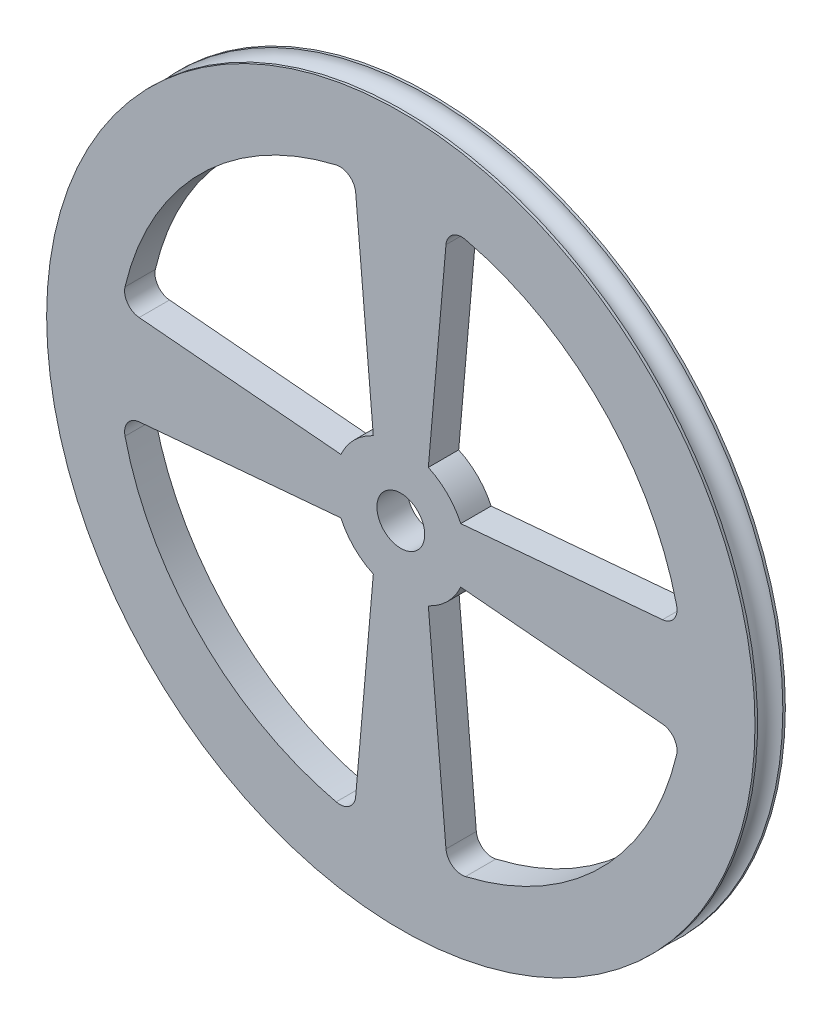
ISO-10303-21;
HEADER;
FILE_DESCRIPTION(('STEP AP214'),'2;1');
FILE_NAME('part.step','',(''),(''),'','','');
FILE_SCHEMA(('AUTOMOTIVE_DESIGN { 1 0 10303 214 1 1 1 1 }'));
ENDSEC;
DATA;
#1=APPLICATION_CONTEXT('core data for automotive mechanical design processes');
#2=APPLICATION_PROTOCOL_DEFINITION('international standard','automotive_design',2000,#1);
#3=PRODUCT_CONTEXT('',#1,'mechanical');
#4=PRODUCT('Part','Part','',(#3));
#5=PRODUCT_RELATED_PRODUCT_CATEGORY('part','',(#4));
#6=PRODUCT_DEFINITION_FORMATION('','',#4);
#7=PRODUCT_DEFINITION_CONTEXT('part definition',#1,'design');
#8=PRODUCT_DEFINITION('design','',#6,#7);
#9=PRODUCT_DEFINITION_SHAPE('','',#8);
#10=(LENGTH_UNIT() NAMED_UNIT(*) SI_UNIT(.MILLI.,.METRE.));
#11=(NAMED_UNIT(*) PLANE_ANGLE_UNIT() SI_UNIT($,.RADIAN.));
#12=(NAMED_UNIT(*) SI_UNIT($,.STERADIAN.) SOLID_ANGLE_UNIT());
#13=UNCERTAINTY_MEASURE_WITH_UNIT(LENGTH_MEASURE(1.E-05),#10,'distance_accuracy_value','');
#14=(GEOMETRIC_REPRESENTATION_CONTEXT(3) GLOBAL_UNCERTAINTY_ASSIGNED_CONTEXT((#13)) GLOBAL_UNIT_ASSIGNED_CONTEXT((#10,
#11,#12)) REPRESENTATION_CONTEXT('',''));
#15=CARTESIAN_POINT('',(0.,0.,0.));
#16=DIRECTION('',(0.,0.,1.));
#17=DIRECTION('',(1.,0.,0.));
#18=AXIS2_PLACEMENT_3D('',#15,#16,#17);
#19=CARTESIAN_POINT('',(0.,0.,3.81));
#20=DIRECTION('',(0.,0.,-1.));
#21=DIRECTION('',(-1.,0.,0.));
#22=AXIS2_PLACEMENT_3D('',#19,#20,#21);
#23=CYLINDRICAL_SURFACE('',#22,44.45);
#24=CARTESIAN_POINT('',(0.,0.,0.317500000000001));
#25=DIRECTION('',(0.,0.,1.));
#26=DIRECTION('',(1.,0.,0.));
#27=AXIS2_PLACEMENT_3D('',#24,#25,#26);
#28=CIRCLE('',#27,44.45);
#29=CARTESIAN_POINT('',(44.45,0.,0.317500000000001));
#30=VERTEX_POINT('',#29);
#31=EDGE_CURVE('E36',#30,#30,#28,.F.);
#32=ORIENTED_EDGE('',*,*,#31,.T.);
#33=EDGE_LOOP('',(#32));
#34=FACE_BOUND('',#33,.T.);
#35=CARTESIAN_POINT('',(0.,0.,0.));
#36=DIRECTION('',(0.,0.,1.));
#37=DIRECTION('',(1.,0.,0.));
#38=AXIS2_PLACEMENT_3D('',#35,#36,#37);
#39=CIRCLE('',#38,44.45);
#40=CARTESIAN_POINT('',(44.45,0.,0.));
#41=VERTEX_POINT('',#40);
#42=EDGE_CURVE('E316',#41,#41,#39,.T.);
#43=ORIENTED_EDGE('',*,*,#42,.T.);
#44=EDGE_LOOP('',(#43));
#45=FACE_BOUND('',#44,.T.);
#46=ADVANCED_FACE('F32',(#34,#45),#23,.T.);
#47=CARTESIAN_POINT('',(0.,0.,3.81));
#48=DIRECTION('',(0.,0.,1.));
#49=DIRECTION('',(1.,0.,0.));
#50=AXIS2_PLACEMENT_3D('',#47,#48,#49);
#51=PLANE('',#50);
#52=DIRECTION('',(0.996194698091746,-0.087155742747654,0.));
#53=VECTOR('',#52,1.);
#54=CARTESIAN_POINT('',(-7.52235999953092,3.4521212229198,3.81));
#55=LINE('',#54,#53);
#56=CARTESIAN_POINT('',(-32.8385381614744,5.66699981589231,3.81));
#57=VERTEX_POINT('',#56);
#58=CARTESIAN_POINT('',(-7.52235999953092,3.4521212229198,3.81));
#59=VERTEX_POINT('',#58);
#60=EDGE_CURVE('E293',#57,#59,#55,.T.);
#61=ORIENTED_EDGE('',*,*,#60,.F.);
#62=CARTESIAN_POINT('',(-32.6642266759791,7.6593892120758,3.81));
#63=DIRECTION('',(0.,0.,1.));
#64=DIRECTION('',(1.,0.,0.));
#65=AXIS2_PLACEMENT_3D('',#62,#63,#64);
#66=CIRCLE('',#65,2.);
#67=CARTESIAN_POINT('',(-34.6114101359556,8.11598156110711,3.81));
#68=VERTEX_POINT('',#67);
#69=EDGE_CURVE('E379',#57,#68,#66,.F.);
#70=ORIENTED_EDGE('',*,*,#69,.T.);
#71=CARTESIAN_POINT('',(0.,0.,3.81));
#72=DIRECTION('',(0.,0.,1.));
#73=DIRECTION('',(1.,0.,0.));
#74=AXIS2_PLACEMENT_3D('',#71,#72,#73);
#75=CIRCLE('',#74,35.5502302144383);
#76=CARTESIAN_POINT('',(-8.11598156110738,34.6114101359555,3.81));
#77=VERTEX_POINT('',#76);
#78=EDGE_CURVE('E290',#77,#68,#75,.T.);
#79=ORIENTED_EDGE('',*,*,#78,.F.);
#80=CARTESIAN_POINT('',(-7.65938921207605,32.664226675979,3.81));
#81=DIRECTION('',(0.,0.,1.));
#82=DIRECTION('',(1.,0.,0.));
#83=AXIS2_PLACEMENT_3D('',#80,#81,#82);
#84=CIRCLE('',#83,2.);
#85=CARTESIAN_POINT('',(-5.66699981589256,32.8385381614743,3.81));
#86=VERTEX_POINT('',#85);
#87=EDGE_CURVE('E375',#77,#86,#84,.F.);
#88=ORIENTED_EDGE('',*,*,#87,.T.);
#89=DIRECTION('',(-0.0871557427476618,0.996194698091745,0.));
#90=VECTOR('',#89,1.);
#91=CARTESIAN_POINT('',(-3.45212122291986,7.5223599995309,3.81));
#92=LINE('',#91,#90);
#93=CARTESIAN_POINT('',(-3.45212122291986,7.5223599995309,3.81));
#94=VERTEX_POINT('',#93);
#95=EDGE_CURVE('E299',#94,#86,#92,.T.);
#96=ORIENTED_EDGE('',*,*,#95,.F.);
#97=CARTESIAN_POINT('',(0.,0.,3.81));
#98=DIRECTION('',(0.,0.,-1.));
#99=DIRECTION('',(1.,0.,0.));
#100=AXIS2_PLACEMENT_3D('',#97,#98,#99);
#101=CIRCLE('',#100,8.2766563840887);
#102=EDGE_CURVE('E296',#59,#94,#101,.T.);
#103=ORIENTED_EDGE('',*,*,#102,.F.);
#104=EDGE_LOOP('',(#61,#70,#79,#88,#96,#103));
#105=FACE_BOUND('',#104,.T.);
#106=CARTESIAN_POINT('',(0.,0.,3.81));
#107=DIRECTION('',(0.,0.,1.));
#108=DIRECTION('',(1.,0.,0.));
#109=AXIS2_PLACEMENT_3D('',#106,#107,#108);
#110=CIRCLE('',#109,44.45);
#111=CARTESIAN_POINT('',(44.45,0.,3.81));
#112=VERTEX_POINT('',#111);
#113=EDGE_CURVE('E317',#112,#112,#110,.T.);
#114=ORIENTED_EDGE('',*,*,#113,.T.);
#115=EDGE_LOOP('',(#114));
#116=FACE_BOUND('',#115,.T.);
#117=CARTESIAN_POINT('',(0.,0.,3.81));
#118=DIRECTION('',(0.,0.,1.));
#119=DIRECTION('',(1.,0.,0.));
#120=AXIS2_PLACEMENT_3D('',#117,#118,#119);
#121=CIRCLE('',#120,3.);
#122=CARTESIAN_POINT('',(3.,0.,3.81));
#123=VERTEX_POINT('',#122);
#124=EDGE_CURVE('E284',#123,#123,#121,.T.);
#125=ORIENTED_EDGE('',*,*,#124,.F.);
#126=EDGE_LOOP('',(#125));
#127=FACE_BOUND('',#126,.T.);
#128=DIRECTION('',(0.087155742747662,-0.996194698091745,0.));
#129=VECTOR('',#128,1.);
#130=CARTESIAN_POINT('',(3.45212122291986,-7.5223599995309,3.81));
#131=LINE('',#130,#129);
#132=CARTESIAN_POINT('',(3.45212122291986,-7.5223599995309,3.81));
#133=VERTEX_POINT('',#132);
#134=CARTESIAN_POINT('',(5.66699981589257,-32.8385381614743,3.81));
#135=VERTEX_POINT('',#134);
#136=EDGE_CURVE('E262',#133,#135,#131,.T.);
#137=ORIENTED_EDGE('',*,*,#136,.F.);
#138=CARTESIAN_POINT('',(0.,0.,3.81));
#139=DIRECTION('',(0.,0.,-1.));
#140=DIRECTION('',(1.,0.,0.));
#141=AXIS2_PLACEMENT_3D('',#138,#139,#140);
#142=CIRCLE('',#141,8.2766563840887);
#143=CARTESIAN_POINT('',(7.52235999953092,-3.4521212229198,3.81));
#144=VERTEX_POINT('',#143);
#145=EDGE_CURVE('E260',#144,#133,#142,.T.);
#146=ORIENTED_EDGE('',*,*,#145,.F.);
#147=DIRECTION('',(-0.996194698091746,0.0871557427476539,0.));
#148=VECTOR('',#147,1.);
#149=CARTESIAN_POINT('',(7.52235999953092,-3.4521212229198,3.81));
#150=LINE('',#149,#148);
#151=CARTESIAN_POINT('',(32.8385381614744,-5.6669998158923,3.81));
#152=VERTEX_POINT('',#151);
#153=EDGE_CURVE('E268',#152,#144,#150,.T.);
#154=ORIENTED_EDGE('',*,*,#153,.F.);
#155=CARTESIAN_POINT('',(32.6642266759791,-7.6593892120758,3.81));
#156=DIRECTION('',(0.,0.,1.));
#157=DIRECTION('',(1.,0.,0.));
#158=AXIS2_PLACEMENT_3D('',#155,#156,#157);
#159=CIRCLE('',#158,2.);
#160=CARTESIAN_POINT('',(34.6114101359556,-8.11598156110711,3.81));
#161=VERTEX_POINT('',#160);
#162=EDGE_CURVE('E334',#152,#161,#159,.F.);
#163=ORIENTED_EDGE('',*,*,#162,.T.);
#164=CARTESIAN_POINT('',(0.,0.,3.81));
#165=DIRECTION('',(0.,0.,1.));
#166=DIRECTION('',(1.,0.,0.));
#167=AXIS2_PLACEMENT_3D('',#164,#165,#166);
#168=CIRCLE('',#167,35.5502302144383);
#169=CARTESIAN_POINT('',(8.11598156110739,-34.6114101359555,3.81));
#170=VERTEX_POINT('',#169);
#171=EDGE_CURVE('E266',#170,#161,#168,.T.);
#172=ORIENTED_EDGE('',*,*,#171,.F.);
#173=CARTESIAN_POINT('',(7.65938921207606,-32.664226675979,3.81));
#174=DIRECTION('',(0.,0.,1.));
#175=DIRECTION('',(1.,0.,0.));
#176=AXIS2_PLACEMENT_3D('',#173,#174,#175);
#177=CIRCLE('',#176,2.);
#178=EDGE_CURVE('E11',#170,#135,#177,.F.);
#179=ORIENTED_EDGE('',*,*,#178,.T.);
#180=EDGE_LOOP('',(#137,#146,#154,#163,#172,#179));
#181=FACE_BOUND('',#180,.T.);
#182=DIRECTION('',(0.0871557427476541,0.996194698091746,0.));
#183=VECTOR('',#182,1.);
#184=CARTESIAN_POINT('',(-3.4521212229198,-7.52235999953092,3.81));
#185=LINE('',#184,#183);
#186=CARTESIAN_POINT('',(-5.66699981589231,-32.8385381614744,3.81));
#187=VERTEX_POINT('',#186);
#188=CARTESIAN_POINT('',(-3.4521212229198,-7.52235999953092,3.81));
#189=VERTEX_POINT('',#188);
#190=EDGE_CURVE('E236',#187,#189,#185,.T.);
#191=ORIENTED_EDGE('',*,*,#190,.F.);
#192=CARTESIAN_POINT('',(-7.6593892120758,-32.6642266759791,3.81));
#193=DIRECTION('',(0.,0.,1.));
#194=DIRECTION('',(1.,0.,0.));
#195=AXIS2_PLACEMENT_3D('',#192,#193,#194);
#196=CIRCLE('',#195,2.);
#197=CARTESIAN_POINT('',(-8.11598156110711,-34.6114101359556,3.81));
#198=VERTEX_POINT('',#197);
#199=EDGE_CURVE('E387',#187,#198,#196,.F.);
#200=ORIENTED_EDGE('',*,*,#199,.T.);
#201=CARTESIAN_POINT('',(0.,0.,3.81));
#202=DIRECTION('',(0.,0.,1.));
#203=DIRECTION('',(1.,0.,0.));
#204=AXIS2_PLACEMENT_3D('',#201,#202,#203);
#205=CIRCLE('',#204,35.5502302144383);
#206=CARTESIAN_POINT('',(-34.6114101359555,-8.11598156110739,3.81));
#207=VERTEX_POINT('',#206);
#208=EDGE_CURVE('E233',#207,#198,#205,.T.);
#209=ORIENTED_EDGE('',*,*,#208,.F.);
#210=CARTESIAN_POINT('',(-32.664226675979,-7.65938921207606,3.81));
#211=DIRECTION('',(0.,0.,1.));
#212=DIRECTION('',(1.,0.,0.));
#213=AXIS2_PLACEMENT_3D('',#210,#211,#212);
#214=CIRCLE('',#213,2.);
#215=CARTESIAN_POINT('',(-32.8385381614743,-5.66699981589257,3.81));
#216=VERTEX_POINT('',#215);
#217=EDGE_CURVE('E383',#207,#216,#214,.F.);
#218=ORIENTED_EDGE('',*,*,#217,.T.);
#219=DIRECTION('',(-0.996194698091745,-0.087155742747662,0.));
#220=VECTOR('',#219,1.);
#221=CARTESIAN_POINT('',(-7.5223599995309,-3.45212122291986,3.81));
#222=LINE('',#221,#220);
#223=CARTESIAN_POINT('',(-7.5223599995309,-3.45212122291986,3.81));
#224=VERTEX_POINT('',#223);
#225=EDGE_CURVE('E242',#224,#216,#222,.T.);
#226=ORIENTED_EDGE('',*,*,#225,.F.);
#227=CARTESIAN_POINT('',(0.,0.,3.81));
#228=DIRECTION('',(0.,0.,-1.));
#229=DIRECTION('',(1.,0.,0.));
#230=AXIS2_PLACEMENT_3D('',#227,#228,#229);
#231=CIRCLE('',#230,8.2766563840887);
#232=EDGE_CURVE('E239',#189,#224,#231,.T.);
#233=ORIENTED_EDGE('',*,*,#232,.F.);
#234=EDGE_LOOP('',(#191,#200,#209,#218,#226,#233));
#235=FACE_BOUND('',#234,.T.);
#236=DIRECTION('',(-0.0871557427476542,-0.996194698091746,0.));
#237=VECTOR('',#236,1.);
#238=CARTESIAN_POINT('',(3.4521212229198,7.52235999953092,3.81));
#239=LINE('',#238,#237);
#240=CARTESIAN_POINT('',(5.66699981589231,32.8385381614744,3.81));
#241=VERTEX_POINT('',#240);
#242=CARTESIAN_POINT('',(3.4521212229198,7.52235999953092,3.81));
#243=VERTEX_POINT('',#242);
#244=EDGE_CURVE('E193',#241,#243,#239,.T.);
#245=ORIENTED_EDGE('',*,*,#244,.F.);
#246=CARTESIAN_POINT('',(7.6593892120758,32.6642266759791,3.81));
#247=DIRECTION('',(0.,0.,1.));
#248=DIRECTION('',(1.,0.,0.));
#249=AXIS2_PLACEMENT_3D('',#246,#247,#248);
#250=CIRCLE('',#249,2.);
#251=CARTESIAN_POINT('',(8.11598156110712,34.6114101359556,3.81));
#252=VERTEX_POINT('',#251);
#253=EDGE_CURVE('E371',#241,#252,#250,.F.);
#254=ORIENTED_EDGE('',*,*,#253,.T.);
#255=CARTESIAN_POINT('',(0.,0.,3.81));
#256=DIRECTION('',(0.,0.,1.));
#257=DIRECTION('',(1.,0.,0.));
#258=AXIS2_PLACEMENT_3D('',#255,#256,#257);
#259=CIRCLE('',#258,35.5502302144382);
#260=CARTESIAN_POINT('',(34.6114101359555,8.11598156110739,3.81));
#261=VERTEX_POINT('',#260);
#262=EDGE_CURVE('E205',#261,#252,#259,.T.);
#263=ORIENTED_EDGE('',*,*,#262,.F.);
#264=CARTESIAN_POINT('',(32.664226675979,7.65938921207606,3.81));
#265=DIRECTION('',(0.,0.,1.));
#266=DIRECTION('',(1.,0.,0.));
#267=AXIS2_PLACEMENT_3D('',#264,#265,#266);
#268=CIRCLE('',#267,2.);
#269=CARTESIAN_POINT('',(32.8385381614743,5.66699981589257,3.81));
#270=VERTEX_POINT('',#269);
#271=EDGE_CURVE('E339',#261,#270,#268,.F.);
#272=ORIENTED_EDGE('',*,*,#271,.T.);
#273=DIRECTION('',(0.996194698091745,0.0871557427476621,0.));
#274=VECTOR('',#273,1.);
#275=CARTESIAN_POINT('',(7.5223599995309,3.45212122291986,3.81));
#276=LINE('',#275,#274);
#277=CARTESIAN_POINT('',(7.5223599995309,3.45212122291986,3.81));
#278=VERTEX_POINT('',#277);
#279=EDGE_CURVE('E218',#278,#270,#276,.T.);
#280=ORIENTED_EDGE('',*,*,#279,.F.);
#281=CARTESIAN_POINT('',(0.,0.,3.81));
#282=DIRECTION('',(0.,0.,-1.));
#283=DIRECTION('',(1.,0.,0.));
#284=AXIS2_PLACEMENT_3D('',#281,#282,#283);
#285=CIRCLE('',#284,8.2766563840887);
#286=EDGE_CURVE('E204',#243,#278,#285,.T.);
#287=ORIENTED_EDGE('',*,*,#286,.F.);
#288=EDGE_LOOP('',(#245,#254,#263,#272,#280,#287));
#289=FACE_BOUND('',#288,.T.);
#290=ADVANCED_FACE('F216',(#105,#116,#127,#181,#235,#289),#51,.T.);
#291=CARTESIAN_POINT('',(0.,0.,0.));
#292=DIRECTION('',(0.,0.,1.));
#293=DIRECTION('',(1.,0.,0.));
#294=AXIS2_PLACEMENT_3D('',#291,#292,#293);
#295=PLANE('',#294);
#296=DIRECTION('',(-0.996194698091745,-0.087155742747662,0.));
#297=VECTOR('',#296,1.);
#298=CARTESIAN_POINT('',(-7.5223599995309,-3.45212122291986,0.));
#299=LINE('',#298,#297);
#300=CARTESIAN_POINT('',(-7.5223599995309,-3.45212122291986,0.));
#301=VERTEX_POINT('',#300);
#302=CARTESIAN_POINT('',(-32.8385381614743,-5.66699981589257,0.));
#303=VERTEX_POINT('',#302);
#304=EDGE_CURVE('E237',#301,#303,#299,.T.);
#305=ORIENTED_EDGE('',*,*,#304,.T.);
#306=CARTESIAN_POINT('',(-32.664226675979,-7.65938921207606,0.));
#307=DIRECTION('',(0.,0.,1.));
#308=DIRECTION('',(1.,0.,0.));
#309=AXIS2_PLACEMENT_3D('',#306,#307,#308);
#310=CIRCLE('',#309,2.);
#311=CARTESIAN_POINT('',(-34.6114101359555,-8.11598156110739,0.));
#312=VERTEX_POINT('',#311);
#313=EDGE_CURVE('E381',#303,#312,#310,.T.);
#314=ORIENTED_EDGE('',*,*,#313,.T.);
#315=CARTESIAN_POINT('',(0.,0.,0.));
#316=DIRECTION('',(0.,0.,1.));
#317=DIRECTION('',(1.,0.,0.));
#318=AXIS2_PLACEMENT_3D('',#315,#316,#317);
#319=CIRCLE('',#318,35.5502302144383);
#320=CARTESIAN_POINT('',(-8.11598156110711,-34.6114101359556,0.));
#321=VERTEX_POINT('',#320);
#322=EDGE_CURVE('E213',#312,#321,#319,.T.);
#323=ORIENTED_EDGE('',*,*,#322,.T.);
#324=CARTESIAN_POINT('',(-7.6593892120758,-32.6642266759791,0.));
#325=DIRECTION('',(0.,0.,1.));
#326=DIRECTION('',(1.,0.,0.));
#327=AXIS2_PLACEMENT_3D('',#324,#325,#326);
#328=CIRCLE('',#327,2.);
#329=CARTESIAN_POINT('',(-5.66699981589231,-32.8385381614744,0.));
#330=VERTEX_POINT('',#329);
#331=EDGE_CURVE('E385',#321,#330,#328,.T.);
#332=ORIENTED_EDGE('',*,*,#331,.T.);
#333=DIRECTION('',(0.0871557427476541,0.996194698091746,0.));
#334=VECTOR('',#333,1.);
#335=CARTESIAN_POINT('',(-3.4521212229198,-7.52235999953092,0.));
#336=LINE('',#335,#334);
#337=CARTESIAN_POINT('',(-3.4521212229198,-7.52235999953092,0.));
#338=VERTEX_POINT('',#337);
#339=EDGE_CURVE('E248',#330,#338,#336,.T.);
#340=ORIENTED_EDGE('',*,*,#339,.T.);
#341=CARTESIAN_POINT('',(0.,0.,0.));
#342=DIRECTION('',(0.,0.,-1.));
#343=DIRECTION('',(1.,0.,0.));
#344=AXIS2_PLACEMENT_3D('',#341,#342,#343);
#345=CIRCLE('',#344,8.2766563840887);
#346=EDGE_CURVE('E250',#338,#301,#345,.T.);
#347=ORIENTED_EDGE('',*,*,#346,.T.);
#348=EDGE_LOOP('',(#305,#314,#323,#332,#340,#347));
#349=FACE_BOUND('',#348,.T.);
#350=CARTESIAN_POINT('',(0.,0.,0.));
#351=DIRECTION('',(0.,0.,1.));
#352=DIRECTION('',(1.,0.,0.));
#353=AXIS2_PLACEMENT_3D('',#350,#351,#352);
#354=CIRCLE('',#353,3.);
#355=CARTESIAN_POINT('',(3.,0.,0.));
#356=VERTEX_POINT('',#355);
#357=EDGE_CURVE('E283',#356,#356,#354,.T.);
#358=ORIENTED_EDGE('',*,*,#357,.T.);
#359=EDGE_LOOP('',(#358));
#360=FACE_BOUND('',#359,.T.);
#361=DIRECTION('',(-0.0871557427476618,0.996194698091745,0.));
#362=VECTOR('',#361,1.);
#363=CARTESIAN_POINT('',(-3.45212122291986,7.5223599995309,0.));
#364=LINE('',#363,#362);
#365=CARTESIAN_POINT('',(-3.45212122291986,7.5223599995309,0.));
#366=VERTEX_POINT('',#365);
#367=CARTESIAN_POINT('',(-5.66699981589256,32.8385381614743,0.));
#368=VERTEX_POINT('',#367);
#369=EDGE_CURVE('E294',#366,#368,#364,.T.);
#370=ORIENTED_EDGE('',*,*,#369,.T.);
#371=CARTESIAN_POINT('',(-7.65938921207605,32.664226675979,0.));
#372=DIRECTION('',(0.,0.,1.));
#373=DIRECTION('',(1.,0.,0.));
#374=AXIS2_PLACEMENT_3D('',#371,#372,#373);
#375=CIRCLE('',#374,2.);
#376=CARTESIAN_POINT('',(-8.11598156110738,34.6114101359555,0.));
#377=VERTEX_POINT('',#376);
#378=EDGE_CURVE('E373',#368,#377,#375,.T.);
#379=ORIENTED_EDGE('',*,*,#378,.T.);
#380=CARTESIAN_POINT('',(0.,0.,0.));
#381=DIRECTION('',(0.,0.,1.));
#382=DIRECTION('',(1.,0.,0.));
#383=AXIS2_PLACEMENT_3D('',#380,#381,#382);
#384=CIRCLE('',#383,35.5502302144383);
#385=CARTESIAN_POINT('',(-34.6114101359556,8.11598156110711,0.));
#386=VERTEX_POINT('',#385);
#387=EDGE_CURVE('E287',#377,#386,#384,.T.);
#388=ORIENTED_EDGE('',*,*,#387,.T.);
#389=CARTESIAN_POINT('',(-32.6642266759791,7.6593892120758,0.));
#390=DIRECTION('',(0.,0.,1.));
#391=DIRECTION('',(1.,0.,0.));
#392=AXIS2_PLACEMENT_3D('',#389,#390,#391);
#393=CIRCLE('',#392,2.);
#394=CARTESIAN_POINT('',(-32.8385381614744,5.66699981589231,0.));
#395=VERTEX_POINT('',#394);
#396=EDGE_CURVE('E377',#386,#395,#393,.T.);
#397=ORIENTED_EDGE('',*,*,#396,.T.);
#398=DIRECTION('',(0.996194698091746,-0.087155742747654,0.));
#399=VECTOR('',#398,1.);
#400=CARTESIAN_POINT('',(-7.52235999953092,3.4521212229198,0.));
#401=LINE('',#400,#399);
#402=CARTESIAN_POINT('',(-7.52235999953092,3.4521212229198,0.));
#403=VERTEX_POINT('',#402);
#404=EDGE_CURVE('E305',#395,#403,#401,.T.);
#405=ORIENTED_EDGE('',*,*,#404,.T.);
#406=CARTESIAN_POINT('',(0.,0.,0.));
#407=DIRECTION('',(0.,0.,-1.));
#408=DIRECTION('',(1.,0.,0.));
#409=AXIS2_PLACEMENT_3D('',#406,#407,#408);
#410=CIRCLE('',#409,8.2766563840887);
#411=EDGE_CURVE('E307',#403,#366,#410,.T.);
#412=ORIENTED_EDGE('',*,*,#411,.T.);
#413=EDGE_LOOP('',(#370,#379,#388,#397,#405,#412));
#414=FACE_BOUND('',#413,.T.);
#415=ORIENTED_EDGE('',*,*,#42,.F.);
#416=EDGE_LOOP('',(#415));
#417=FACE_BOUND('',#416,.T.);
#418=CARTESIAN_POINT('',(0.,0.,0.));
#419=DIRECTION('',(0.,0.,-1.));
#420=DIRECTION('',(1.,0.,0.));
#421=AXIS2_PLACEMENT_3D('',#418,#419,#420);
#422=CIRCLE('',#421,8.2766563840887);
#423=CARTESIAN_POINT('',(7.52235999953092,-3.4521212229198,0.));
#424=VERTEX_POINT('',#423);
#425=CARTESIAN_POINT('',(3.45212122291986,-7.5223599995309,0.));
#426=VERTEX_POINT('',#425);
#427=EDGE_CURVE('E259',#424,#426,#422,.T.);
#428=ORIENTED_EDGE('',*,*,#427,.T.);
#429=DIRECTION('',(0.087155742747662,-0.996194698091745,0.));
#430=VECTOR('',#429,1.);
#431=CARTESIAN_POINT('',(3.45212122291986,-7.5223599995309,0.));
#432=LINE('',#431,#430);
#433=CARTESIAN_POINT('',(5.66699981589257,-32.8385381614743,0.));
#434=VERTEX_POINT('',#433);
#435=EDGE_CURVE('E273',#426,#434,#432,.T.);
#436=ORIENTED_EDGE('',*,*,#435,.T.);
#437=CARTESIAN_POINT('',(7.65938921207606,-32.664226675979,0.));
#438=DIRECTION('',(0.,0.,1.));
#439=DIRECTION('',(1.,0.,0.));
#440=AXIS2_PLACEMENT_3D('',#437,#438,#439);
#441=CIRCLE('',#440,2.);
#442=CARTESIAN_POINT('',(8.11598156110739,-34.6114101359555,0.));
#443=VERTEX_POINT('',#442);
#444=EDGE_CURVE('E41',#434,#443,#441,.T.);
#445=ORIENTED_EDGE('',*,*,#444,.T.);
#446=CARTESIAN_POINT('',(0.,0.,0.));
#447=DIRECTION('',(0.,0.,1.));
#448=DIRECTION('',(1.,0.,0.));
#449=AXIS2_PLACEMENT_3D('',#446,#447,#448);
#450=CIRCLE('',#449,35.5502302144383);
#451=CARTESIAN_POINT('',(34.6114101359556,-8.11598156110711,0.));
#452=VERTEX_POINT('',#451);
#453=EDGE_CURVE('E275',#443,#452,#450,.T.);
#454=ORIENTED_EDGE('',*,*,#453,.T.);
#455=CARTESIAN_POINT('',(32.6642266759791,-7.6593892120758,0.));
#456=DIRECTION('',(0.,0.,1.));
#457=DIRECTION('',(1.,0.,0.));
#458=AXIS2_PLACEMENT_3D('',#455,#456,#457);
#459=CIRCLE('',#458,2.);
#460=CARTESIAN_POINT('',(32.8385381614744,-5.6669998158923,0.));
#461=VERTEX_POINT('',#460);
#462=EDGE_CURVE('E332',#452,#461,#459,.T.);
#463=ORIENTED_EDGE('',*,*,#462,.T.);
#464=DIRECTION('',(-0.996194698091746,0.0871557427476539,0.));
#465=VECTOR('',#464,1.);
#466=CARTESIAN_POINT('',(7.52235999953092,-3.4521212229198,0.));
#467=LINE('',#466,#465);
#468=EDGE_CURVE('E263',#461,#424,#467,.T.);
#469=ORIENTED_EDGE('',*,*,#468,.T.);
#470=EDGE_LOOP('',(#428,#436,#445,#454,#463,#469));
#471=FACE_BOUND('',#470,.T.);
#472=DIRECTION('',(0.996194698091745,0.0871557427476621,0.));
#473=VECTOR('',#472,1.);
#474=CARTESIAN_POINT('',(7.5223599995309,3.45212122291986,0.));
#475=LINE('',#474,#473);
#476=CARTESIAN_POINT('',(7.5223599995309,3.45212122291986,0.));
#477=VERTEX_POINT('',#476);
#478=CARTESIAN_POINT('',(32.8385381614743,5.66699981589257,0.));
#479=VERTEX_POINT('',#478);
#480=EDGE_CURVE('E229',#477,#479,#475,.T.);
#481=ORIENTED_EDGE('',*,*,#480,.T.);
#482=CARTESIAN_POINT('',(32.664226675979,7.65938921207606,0.));
#483=DIRECTION('',(0.,0.,1.));
#484=DIRECTION('',(1.,0.,0.));
#485=AXIS2_PLACEMENT_3D('',#482,#483,#484);
#486=CIRCLE('',#485,2.);
#487=CARTESIAN_POINT('',(34.6114101359555,8.11598156110739,0.));
#488=VERTEX_POINT('',#487);
#489=EDGE_CURVE('E337',#479,#488,#486,.T.);
#490=ORIENTED_EDGE('',*,*,#489,.T.);
#491=CARTESIAN_POINT('',(0.,0.,0.));
#492=DIRECTION('',(0.,0.,1.));
#493=DIRECTION('',(1.,0.,0.));
#494=AXIS2_PLACEMENT_3D('',#491,#492,#493);
#495=CIRCLE('',#494,35.5502302144382);
#496=CARTESIAN_POINT('',(8.11598156110712,34.6114101359556,0.));
#497=VERTEX_POINT('',#496);
#498=EDGE_CURVE('E223',#488,#497,#495,.T.);
#499=ORIENTED_EDGE('',*,*,#498,.T.);
#500=CARTESIAN_POINT('',(7.6593892120758,32.6642266759791,0.));
#501=DIRECTION('',(0.,0.,1.));
#502=DIRECTION('',(1.,0.,0.));
#503=AXIS2_PLACEMENT_3D('',#500,#501,#502);
#504=CIRCLE('',#503,2.);
#505=CARTESIAN_POINT('',(5.66699981589231,32.8385381614744,0.));
#506=VERTEX_POINT('',#505);
#507=EDGE_CURVE('E369',#497,#506,#504,.T.);
#508=ORIENTED_EDGE('',*,*,#507,.T.);
#509=DIRECTION('',(-0.0871557427476542,-0.996194698091746,0.));
#510=VECTOR('',#509,1.);
#511=CARTESIAN_POINT('',(3.4521212229198,7.52235999953092,0.));
#512=LINE('',#511,#510);
#513=CARTESIAN_POINT('',(3.4521212229198,7.52235999953092,0.));
#514=VERTEX_POINT('',#513);
#515=EDGE_CURVE('E226',#506,#514,#512,.T.);
#516=ORIENTED_EDGE('',*,*,#515,.T.);
#517=CARTESIAN_POINT('',(0.,0.,0.));
#518=DIRECTION('',(0.,0.,-1.));
#519=DIRECTION('',(1.,0.,0.));
#520=AXIS2_PLACEMENT_3D('',#517,#518,#519);
#521=CIRCLE('',#520,8.2766563840887);
#522=EDGE_CURVE('E212',#514,#477,#521,.T.);
#523=ORIENTED_EDGE('',*,*,#522,.T.);
#524=EDGE_LOOP('',(#481,#490,#499,#508,#516,#523));
#525=FACE_BOUND('',#524,.T.);
#526=ADVANCED_FACE('F414',(#349,#360,#414,#417,#471,#525),#295,.F.);
#527=CARTESIAN_POINT('',(0.,0.,3.4925));
#528=DIRECTION('',(0.,0.,-1.));
#529=DIRECTION('',(-1.,0.,0.));
#530=AXIS2_PLACEMENT_3D('',#527,#528,#529);
#531=CIRCLE('',#530,44.45);
#532=CARTESIAN_POINT('',(-44.45,0.,3.4925));
#533=VERTEX_POINT('',#532);
#534=EDGE_CURVE('E389',#533,#533,#531,.F.);
#535=ORIENTED_EDGE('',*,*,#534,.T.);
#536=EDGE_LOOP('',(#535));
#537=FACE_BOUND('',#536,.T.);
#538=ORIENTED_EDGE('',*,*,#113,.F.);
#539=EDGE_LOOP('',(#538));
#540=FACE_BOUND('',#539,.T.);
#541=ADVANCED_FACE('F410',(#537,#540),#23,.T.);
#542=CARTESIAN_POINT('',(0.,0.,3.81));
#543=DIRECTION('',(0.,0.,-1.));
#544=DIRECTION('',(-1.,0.,0.));
#545=AXIS2_PLACEMENT_3D('',#542,#543,#544);
#546=CYLINDRICAL_SURFACE('',#545,35.5502302144383);
#547=ORIENTED_EDGE('',*,*,#387,.F.);
#548=DIRECTION('',(0.,0.,-1.));
#549=VECTOR('',#548,1.);
#550=CARTESIAN_POINT('',(-8.11598156110738,34.6114101359555,3.81));
#551=LINE('',#550,#549);
#552=EDGE_CURVE('E351',#377,#77,#551,.F.);
#553=ORIENTED_EDGE('',*,*,#552,.T.);
#554=ORIENTED_EDGE('',*,*,#78,.T.);
#555=DIRECTION('',(0.,0.,-1.));
#556=VECTOR('',#555,1.);
#557=CARTESIAN_POINT('',(-34.6114101359556,8.11598156110711,3.81));
#558=LINE('',#557,#556);
#559=EDGE_CURVE('E348',#68,#386,#558,.T.);
#560=ORIENTED_EDGE('',*,*,#559,.T.);
#561=EDGE_LOOP('',(#547,#553,#554,#560));
#562=FACE_BOUND('',#561,.T.);
#563=ADVANCED_FACE('F420',(#562),#546,.F.);
#564=CARTESIAN_POINT('',(-7.52235999953092,3.4521212229198,3.81));
#565=DIRECTION('',(0.087155742747654,0.996194698091746,0.));
#566=DIRECTION('',(-0.996194698091746,0.087155742747654,0.));
#567=AXIS2_PLACEMENT_3D('',#564,#565,#566);
#568=PLANE('',#567);
#569=ORIENTED_EDGE('',*,*,#404,.F.);
#570=DIRECTION('',(0.,0.,1.));
#571=VECTOR('',#570,1.);
#572=CARTESIAN_POINT('',(-32.8385381614744,5.66699981589231,3.81));
#573=LINE('',#572,#571);
#574=EDGE_CURVE('E353',#395,#57,#573,.T.);
#575=ORIENTED_EDGE('',*,*,#574,.T.);
#576=ORIENTED_EDGE('',*,*,#60,.T.);
#577=DIRECTION('',(0.,0.,-1.));
#578=VECTOR('',#577,1.);
#579=CARTESIAN_POINT('',(-7.52235999953092,3.4521212229198,3.81));
#580=LINE('',#579,#578);
#581=EDGE_CURVE('E313',#59,#403,#580,.T.);
#582=ORIENTED_EDGE('',*,*,#581,.T.);
#583=EDGE_LOOP('',(#569,#575,#576,#582));
#584=FACE_BOUND('',#583,.T.);
#585=ADVANCED_FACE('F425',(#584),#568,.T.);
#586=CARTESIAN_POINT('',(0.,0.,3.81));
#587=DIRECTION('',(0.,0.,-1.));
#588=DIRECTION('',(-1.,0.,0.));
#589=AXIS2_PLACEMENT_3D('',#586,#587,#588);
#590=CYLINDRICAL_SURFACE('',#589,8.2766563840887);
#591=ORIENTED_EDGE('',*,*,#411,.F.);
#592=ORIENTED_EDGE('',*,*,#581,.F.);
#593=ORIENTED_EDGE('',*,*,#102,.T.);
#594=DIRECTION('',(0.,0.,-1.));
#595=VECTOR('',#594,1.);
#596=CARTESIAN_POINT('',(-3.45212122291986,7.5223599995309,3.81));
#597=LINE('',#596,#595);
#598=EDGE_CURVE('E302',#94,#366,#597,.T.);
#599=ORIENTED_EDGE('',*,*,#598,.T.);
#600=EDGE_LOOP('',(#591,#592,#593,#599));
#601=FACE_BOUND('',#600,.T.);
#602=ADVANCED_FACE('F497',(#601),#590,.T.);
#603=CARTESIAN_POINT('',(-3.45212122291986,7.5223599995309,3.81));
#604=DIRECTION('',(-0.996194698091745,-0.0871557427476618,0.));
#605=DIRECTION('',(0.0871557427476618,-0.996194698091745,0.));
#606=AXIS2_PLACEMENT_3D('',#603,#604,#605);
#607=PLANE('',#606);
#608=ORIENTED_EDGE('',*,*,#95,.T.);
#609=DIRECTION('',(0.,0.,1.));
#610=VECTOR('',#609,1.);
#611=CARTESIAN_POINT('',(-5.66699981589256,32.8385381614743,0.));
#612=LINE('',#611,#610);
#613=EDGE_CURVE('E345',#86,#368,#612,.F.);
#614=ORIENTED_EDGE('',*,*,#613,.T.);
#615=ORIENTED_EDGE('',*,*,#369,.F.);
#616=ORIENTED_EDGE('',*,*,#598,.F.);
#617=EDGE_LOOP('',(#608,#614,#615,#616));
#618=FACE_BOUND('',#617,.T.);
#619=ADVANCED_FACE('F493',(#618),#607,.T.);
#620=CARTESIAN_POINT('',(0.,0.,3.81));
#621=DIRECTION('',(0.,0.,-1.));
#622=DIRECTION('',(-1.,0.,0.));
#623=AXIS2_PLACEMENT_3D('',#620,#621,#622);
#624=CYLINDRICAL_SURFACE('',#623,3.);
#625=ORIENTED_EDGE('',*,*,#124,.T.);
#626=EDGE_LOOP('',(#625));
#627=FACE_BOUND('',#626,.T.);
#628=ORIENTED_EDGE('',*,*,#357,.F.);
#629=EDGE_LOOP('',(#628));
#630=FACE_BOUND('',#629,.T.);
#631=ADVANCED_FACE('F489',(#627,#630),#624,.F.);
#632=CARTESIAN_POINT('',(0.,0.,3.81));
#633=DIRECTION('',(0.,0.,-1.));
#634=DIRECTION('',(-1.,0.,0.));
#635=AXIS2_PLACEMENT_3D('',#632,#633,#634);
#636=CYLINDRICAL_SURFACE('',#635,8.2766563840887);
#637=ORIENTED_EDGE('',*,*,#427,.F.);
#638=DIRECTION('',(0.,0.,-1.));
#639=VECTOR('',#638,1.);
#640=CARTESIAN_POINT('',(7.52235999953092,-3.4521212229198,3.81));
#641=LINE('',#640,#639);
#642=EDGE_CURVE('E270',#144,#424,#641,.T.);
#643=ORIENTED_EDGE('',*,*,#642,.F.);
#644=ORIENTED_EDGE('',*,*,#145,.T.);
#645=DIRECTION('',(0.,0.,-1.));
#646=VECTOR('',#645,1.);
#647=CARTESIAN_POINT('',(3.45212122291986,-7.5223599995309,3.81));
#648=LINE('',#647,#646);
#649=EDGE_CURVE('E280',#133,#426,#648,.T.);
#650=ORIENTED_EDGE('',*,*,#649,.T.);
#651=EDGE_LOOP('',(#637,#643,#644,#650));
#652=FACE_BOUND('',#651,.T.);
#653=ADVANCED_FACE('F485',(#652),#636,.T.);
#654=CARTESIAN_POINT('',(3.45212122291986,-7.5223599995309,3.81));
#655=DIRECTION('',(0.996194698091745,0.087155742747662,0.));
#656=DIRECTION('',(-0.087155742747662,0.996194698091745,0.));
#657=AXIS2_PLACEMENT_3D('',#654,#655,#656);
#658=PLANE('',#657);
#659=ORIENTED_EDGE('',*,*,#136,.T.);
#660=DIRECTION('',(0.,0.,1.));
#661=VECTOR('',#660,1.);
#662=CARTESIAN_POINT('',(5.66699981589257,-32.8385381614743,0.));
#663=LINE('',#662,#661);
#664=EDGE_CURVE('E365',#135,#434,#663,.F.);
#665=ORIENTED_EDGE('',*,*,#664,.T.);
#666=ORIENTED_EDGE('',*,*,#435,.F.);
#667=ORIENTED_EDGE('',*,*,#649,.F.);
#668=EDGE_LOOP('',(#659,#665,#666,#667));
#669=FACE_BOUND('',#668,.T.);
#670=ADVANCED_FACE('F482',(#669),#658,.T.);
#671=CARTESIAN_POINT('',(0.,0.,3.81));
#672=DIRECTION('',(0.,0.,-1.));
#673=DIRECTION('',(-1.,0.,0.));
#674=AXIS2_PLACEMENT_3D('',#671,#672,#673);
#675=CYLINDRICAL_SURFACE('',#674,35.5502302144383);
#676=ORIENTED_EDGE('',*,*,#453,.F.);
#677=DIRECTION('',(0.,0.,-1.));
#678=VECTOR('',#677,1.);
#679=CARTESIAN_POINT('',(8.11598156110739,-34.6114101359555,3.81));
#680=LINE('',#679,#678);
#681=EDGE_CURVE('E55',#443,#170,#680,.F.);
#682=ORIENTED_EDGE('',*,*,#681,.T.);
#683=ORIENTED_EDGE('',*,*,#171,.T.);
#684=DIRECTION('',(0.,0.,-1.));
#685=VECTOR('',#684,1.);
#686=CARTESIAN_POINT('',(34.6114101359556,-8.11598156110711,3.81));
#687=LINE('',#686,#685);
#688=EDGE_CURVE('E320',#161,#452,#687,.T.);
#689=ORIENTED_EDGE('',*,*,#688,.T.);
#690=EDGE_LOOP('',(#676,#682,#683,#689));
#691=FACE_BOUND('',#690,.T.);
#692=ADVANCED_FACE('F478',(#691),#675,.F.);
#693=CARTESIAN_POINT('',(7.52235999953092,-3.4521212229198,3.81));
#694=DIRECTION('',(-0.0871557427476539,-0.996194698091746,0.));
#695=DIRECTION('',(0.996194698091746,-0.0871557427476539,0.));
#696=AXIS2_PLACEMENT_3D('',#693,#694,#695);
#697=PLANE('',#696);
#698=ORIENTED_EDGE('',*,*,#468,.F.);
#699=DIRECTION('',(0.,0.,1.));
#700=VECTOR('',#699,1.);
#701=CARTESIAN_POINT('',(32.8385381614744,-5.66699981589231,3.81));
#702=LINE('',#701,#700);
#703=EDGE_CURVE('E325',#461,#152,#702,.T.);
#704=ORIENTED_EDGE('',*,*,#703,.T.);
#705=ORIENTED_EDGE('',*,*,#153,.T.);
#706=ORIENTED_EDGE('',*,*,#642,.T.);
#707=EDGE_LOOP('',(#698,#704,#705,#706));
#708=FACE_BOUND('',#707,.T.);
#709=ADVANCED_FACE('F472',(#708),#697,.T.);
#710=CARTESIAN_POINT('',(0.,0.,3.81));
#711=DIRECTION('',(0.,0.,-1.));
#712=DIRECTION('',(-1.,0.,0.));
#713=AXIS2_PLACEMENT_3D('',#710,#711,#712);
#714=CYLINDRICAL_SURFACE('',#713,35.5502302144383);
#715=ORIENTED_EDGE('',*,*,#322,.F.);
#716=DIRECTION('',(0.,0.,-1.));
#717=VECTOR('',#716,1.);
#718=CARTESIAN_POINT('',(-34.6114101359555,-8.11598156110739,3.81));
#719=LINE('',#718,#717);
#720=EDGE_CURVE('E361',#312,#207,#719,.F.);
#721=ORIENTED_EDGE('',*,*,#720,.T.);
#722=ORIENTED_EDGE('',*,*,#208,.T.);
#723=DIRECTION('',(0.,0.,-1.));
#724=VECTOR('',#723,1.);
#725=CARTESIAN_POINT('',(-8.11598156110711,-34.6114101359556,3.81));
#726=LINE('',#725,#724);
#727=EDGE_CURVE('E358',#198,#321,#726,.T.);
#728=ORIENTED_EDGE('',*,*,#727,.T.);
#729=EDGE_LOOP('',(#715,#721,#722,#728));
#730=FACE_BOUND('',#729,.T.);
#731=ADVANCED_FACE('F450',(#730),#714,.F.);
#732=CARTESIAN_POINT('',(-3.4521212229198,-7.52235999953092,3.81));
#733=DIRECTION('',(-0.996194698091746,0.0871557427476541,0.));
#734=DIRECTION('',(-0.0871557427476541,-0.996194698091746,0.));
#735=AXIS2_PLACEMENT_3D('',#732,#733,#734);
#736=PLANE('',#735);
#737=ORIENTED_EDGE('',*,*,#339,.F.);
#738=DIRECTION('',(0.,0.,1.));
#739=VECTOR('',#738,1.);
#740=CARTESIAN_POINT('',(-5.66699981589231,-32.8385381614744,3.81));
#741=LINE('',#740,#739);
#742=EDGE_CURVE('E363',#330,#187,#741,.T.);
#743=ORIENTED_EDGE('',*,*,#742,.T.);
#744=ORIENTED_EDGE('',*,*,#190,.T.);
#745=DIRECTION('',(0.,0.,-1.));
#746=VECTOR('',#745,1.);
#747=CARTESIAN_POINT('',(-3.4521212229198,-7.52235999953092,3.81));
#748=LINE('',#747,#746);
#749=EDGE_CURVE('E256',#189,#338,#748,.T.);
#750=ORIENTED_EDGE('',*,*,#749,.T.);
#751=EDGE_LOOP('',(#737,#743,#744,#750));
#752=FACE_BOUND('',#751,.T.);
#753=ADVANCED_FACE('F464',(#752),#736,.T.);
#754=CARTESIAN_POINT('',(0.,0.,3.81));
#755=DIRECTION('',(0.,0.,-1.));
#756=DIRECTION('',(-1.,0.,0.));
#757=AXIS2_PLACEMENT_3D('',#754,#755,#756);
#758=CYLINDRICAL_SURFACE('',#757,8.2766563840887);
#759=ORIENTED_EDGE('',*,*,#346,.F.);
#760=ORIENTED_EDGE('',*,*,#749,.F.);
#761=ORIENTED_EDGE('',*,*,#232,.T.);
#762=DIRECTION('',(0.,0.,-1.));
#763=VECTOR('',#762,1.);
#764=CARTESIAN_POINT('',(-7.5223599995309,-3.45212122291986,3.81));
#765=LINE('',#764,#763);
#766=EDGE_CURVE('E245',#224,#301,#765,.T.);
#767=ORIENTED_EDGE('',*,*,#766,.T.);
#768=EDGE_LOOP('',(#759,#760,#761,#767));
#769=FACE_BOUND('',#768,.T.);
#770=ADVANCED_FACE('F463',(#769),#758,.T.);
#771=CARTESIAN_POINT('',(-7.5223599995309,-3.45212122291986,3.81));
#772=DIRECTION('',(0.087155742747662,-0.996194698091745,0.));
#773=DIRECTION('',(0.996194698091745,0.087155742747662,0.));
#774=AXIS2_PLACEMENT_3D('',#771,#772,#773);
#775=PLANE('',#774);
#776=ORIENTED_EDGE('',*,*,#225,.T.);
#777=DIRECTION('',(0.,0.,1.));
#778=VECTOR('',#777,1.);
#779=CARTESIAN_POINT('',(-32.8385381614743,-5.66699981589257,0.));
#780=LINE('',#779,#778);
#781=EDGE_CURVE('E355',#216,#303,#780,.F.);
#782=ORIENTED_EDGE('',*,*,#781,.T.);
#783=ORIENTED_EDGE('',*,*,#304,.F.);
#784=ORIENTED_EDGE('',*,*,#766,.F.);
#785=EDGE_LOOP('',(#776,#782,#783,#784));
#786=FACE_BOUND('',#785,.T.);
#787=ADVANCED_FACE('F460',(#786),#775,.T.);
#788=CARTESIAN_POINT('',(0.,0.,3.81));
#789=DIRECTION('',(0.,0.,-1.));
#790=DIRECTION('',(-1.,0.,0.));
#791=AXIS2_PLACEMENT_3D('',#788,#789,#790);
#792=CYLINDRICAL_SURFACE('',#791,35.5502302144382);
#793=ORIENTED_EDGE('',*,*,#262,.T.);
#794=DIRECTION('',(0.,0.,-1.));
#795=VECTOR('',#794,1.);
#796=CARTESIAN_POINT('',(8.11598156110712,34.6114101359556,3.81));
#797=LINE('',#796,#795);
#798=EDGE_CURVE('E341',#252,#497,#797,.T.);
#799=ORIENTED_EDGE('',*,*,#798,.T.);
#800=ORIENTED_EDGE('',*,*,#498,.F.);
#801=DIRECTION('',(0.,0.,-1.));
#802=VECTOR('',#801,1.);
#803=CARTESIAN_POINT('',(34.6114101359555,8.11598156110739,3.81));
#804=LINE('',#803,#802);
#805=EDGE_CURVE('E330',#488,#261,#804,.F.);
#806=ORIENTED_EDGE('',*,*,#805,.T.);
#807=EDGE_LOOP('',(#793,#799,#800,#806));
#808=FACE_BOUND('',#807,.T.);
#809=ADVANCED_FACE('F542',(#808),#792,.F.);
#810=CARTESIAN_POINT('',(3.4521212229198,7.52235999953092,3.81));
#811=DIRECTION('',(0.996194698091746,-0.0871557427476542,0.));
#812=DIRECTION('',(0.0871557427476542,0.996194698091746,0.));
#813=AXIS2_PLACEMENT_3D('',#810,#811,#812);
#814=PLANE('',#813);
#815=ORIENTED_EDGE('',*,*,#515,.F.);
#816=DIRECTION('',(0.,0.,1.));
#817=VECTOR('',#816,1.);
#818=CARTESIAN_POINT('',(5.66699981589231,32.8385381614744,3.81));
#819=LINE('',#818,#817);
#820=EDGE_CURVE('E200',#506,#241,#819,.T.);
#821=ORIENTED_EDGE('',*,*,#820,.T.);
#822=ORIENTED_EDGE('',*,*,#244,.T.);
#823=DIRECTION('',(0.,0.,-1.));
#824=VECTOR('',#823,1.);
#825=CARTESIAN_POINT('',(3.4521212229198,7.52235999953092,3.81));
#826=LINE('',#825,#824);
#827=EDGE_CURVE('E197',#243,#514,#826,.T.);
#828=ORIENTED_EDGE('',*,*,#827,.T.);
#829=EDGE_LOOP('',(#815,#821,#822,#828));
#830=FACE_BOUND('',#829,.T.);
#831=ADVANCED_FACE('F196',(#830),#814,.T.);
#832=CARTESIAN_POINT('',(0.,0.,3.81));
#833=DIRECTION('',(0.,0.,-1.));
#834=DIRECTION('',(-1.,0.,0.));
#835=AXIS2_PLACEMENT_3D('',#832,#833,#834);
#836=CYLINDRICAL_SURFACE('',#835,8.2766563840887);
#837=ORIENTED_EDGE('',*,*,#522,.F.);
#838=ORIENTED_EDGE('',*,*,#827,.F.);
#839=ORIENTED_EDGE('',*,*,#286,.T.);
#840=DIRECTION('',(0.,0.,-1.));
#841=VECTOR('',#840,1.);
#842=CARTESIAN_POINT('',(7.5223599995309,3.45212122291986,3.81));
#843=LINE('',#842,#841);
#844=EDGE_CURVE('E214',#278,#477,#843,.T.);
#845=ORIENTED_EDGE('',*,*,#844,.T.);
#846=EDGE_LOOP('',(#837,#838,#839,#845));
#847=FACE_BOUND('',#846,.T.);
#848=ADVANCED_FACE('F209',(#847),#836,.T.);
#849=CARTESIAN_POINT('',(7.5223599995309,3.45212122291986,3.81));
#850=DIRECTION('',(-0.0871557427476621,0.996194698091745,0.));
#851=DIRECTION('',(-0.996194698091745,-0.0871557427476621,0.));
#852=AXIS2_PLACEMENT_3D('',#849,#850,#851);
#853=PLANE('',#852);
#854=ORIENTED_EDGE('',*,*,#279,.T.);
#855=DIRECTION('',(0.,0.,1.));
#856=VECTOR('',#855,1.);
#857=CARTESIAN_POINT('',(32.8385381614743,5.66699981589257,0.));
#858=LINE('',#857,#856);
#859=EDGE_CURVE('E327',#270,#479,#858,.F.);
#860=ORIENTED_EDGE('',*,*,#859,.T.);
#861=ORIENTED_EDGE('',*,*,#480,.F.);
#862=ORIENTED_EDGE('',*,*,#844,.F.);
#863=EDGE_LOOP('',(#854,#860,#861,#862));
#864=FACE_BOUND('',#863,.T.);
#865=ADVANCED_FACE('F533',(#864),#853,.T.);
#866=CARTESIAN_POINT('',(32.6642266759791,-7.6593892120758,3.81));
#867=DIRECTION('',(0.,0.,-1.));
#868=DIRECTION('',(-1.,0.,0.));
#869=AXIS2_PLACEMENT_3D('',#866,#867,#868);
#870=CYLINDRICAL_SURFACE('',#869,2.);
#871=ORIENTED_EDGE('',*,*,#162,.F.);
#872=ORIENTED_EDGE('',*,*,#703,.F.);
#873=ORIENTED_EDGE('',*,*,#462,.F.);
#874=ORIENTED_EDGE('',*,*,#688,.F.);
#875=EDGE_LOOP('',(#871,#872,#873,#874));
#876=FACE_BOUND('',#875,.T.);
#877=ADVANCED_FACE('F553',(#876),#870,.F.);
#878=CARTESIAN_POINT('',(32.664226675979,7.65938921207606,3.81));
#879=DIRECTION('',(0.,0.,-1.));
#880=DIRECTION('',(-1.,0.,0.));
#881=AXIS2_PLACEMENT_3D('',#878,#879,#880);
#882=CYLINDRICAL_SURFACE('',#881,2.);
#883=ORIENTED_EDGE('',*,*,#271,.F.);
#884=ORIENTED_EDGE('',*,*,#805,.F.);
#885=ORIENTED_EDGE('',*,*,#489,.F.);
#886=ORIENTED_EDGE('',*,*,#859,.F.);
#887=EDGE_LOOP('',(#883,#884,#885,#886));
#888=FACE_BOUND('',#887,.T.);
#889=ADVANCED_FACE('F537',(#888),#882,.F.);
#890=CARTESIAN_POINT('',(7.6593892120758,32.6642266759791,3.81));
#891=DIRECTION('',(0.,0.,-1.));
#892=DIRECTION('',(-1.,0.,0.));
#893=AXIS2_PLACEMENT_3D('',#890,#891,#892);
#894=CYLINDRICAL_SURFACE('',#893,2.);
#895=ORIENTED_EDGE('',*,*,#253,.F.);
#896=ORIENTED_EDGE('',*,*,#820,.F.);
#897=ORIENTED_EDGE('',*,*,#507,.F.);
#898=ORIENTED_EDGE('',*,*,#798,.F.);
#899=EDGE_LOOP('',(#895,#896,#897,#898));
#900=FACE_BOUND('',#899,.T.);
#901=ADVANCED_FACE('F545',(#900),#894,.F.);
#902=CARTESIAN_POINT('',(-7.65938921207605,32.664226675979,3.81));
#903=DIRECTION('',(0.,0.,-1.));
#904=DIRECTION('',(-1.,0.,0.));
#905=AXIS2_PLACEMENT_3D('',#902,#903,#904);
#906=CYLINDRICAL_SURFACE('',#905,2.);
#907=ORIENTED_EDGE('',*,*,#87,.F.);
#908=ORIENTED_EDGE('',*,*,#552,.F.);
#909=ORIENTED_EDGE('',*,*,#378,.F.);
#910=ORIENTED_EDGE('',*,*,#613,.F.);
#911=EDGE_LOOP('',(#907,#908,#909,#910));
#912=FACE_BOUND('',#911,.T.);
#913=ADVANCED_FACE('F522',(#912),#906,.F.);
#914=CARTESIAN_POINT('',(-32.6642266759791,7.6593892120758,3.81));
#915=DIRECTION('',(0.,0.,-1.));
#916=DIRECTION('',(-1.,0.,0.));
#917=AXIS2_PLACEMENT_3D('',#914,#915,#916);
#918=CYLINDRICAL_SURFACE('',#917,2.);
#919=ORIENTED_EDGE('',*,*,#69,.F.);
#920=ORIENTED_EDGE('',*,*,#574,.F.);
#921=ORIENTED_EDGE('',*,*,#396,.F.);
#922=ORIENTED_EDGE('',*,*,#559,.F.);
#923=EDGE_LOOP('',(#919,#920,#921,#922));
#924=FACE_BOUND('',#923,.T.);
#925=ADVANCED_FACE('F514',(#924),#918,.F.);
#926=CARTESIAN_POINT('',(-32.664226675979,-7.65938921207606,3.81));
#927=DIRECTION('',(0.,0.,-1.));
#928=DIRECTION('',(-1.,0.,0.));
#929=AXIS2_PLACEMENT_3D('',#926,#927,#928);
#930=CYLINDRICAL_SURFACE('',#929,2.);
#931=ORIENTED_EDGE('',*,*,#217,.F.);
#932=ORIENTED_EDGE('',*,*,#720,.F.);
#933=ORIENTED_EDGE('',*,*,#313,.F.);
#934=ORIENTED_EDGE('',*,*,#781,.F.);
#935=EDGE_LOOP('',(#931,#932,#933,#934));
#936=FACE_BOUND('',#935,.T.);
#937=ADVANCED_FACE('F458',(#936),#930,.F.);
#938=CARTESIAN_POINT('',(-7.6593892120758,-32.6642266759791,3.81));
#939=DIRECTION('',(0.,0.,-1.));
#940=DIRECTION('',(-1.,0.,0.));
#941=AXIS2_PLACEMENT_3D('',#938,#939,#940);
#942=CYLINDRICAL_SURFACE('',#941,2.);
#943=ORIENTED_EDGE('',*,*,#199,.F.);
#944=ORIENTED_EDGE('',*,*,#742,.F.);
#945=ORIENTED_EDGE('',*,*,#331,.F.);
#946=ORIENTED_EDGE('',*,*,#727,.F.);
#947=EDGE_LOOP('',(#943,#944,#945,#946));
#948=FACE_BOUND('',#947,.T.);
#949=ADVANCED_FACE('F405',(#948),#942,.F.);
#950=CARTESIAN_POINT('',(7.65938921207606,-32.664226675979,3.81));
#951=DIRECTION('',(0.,0.,-1.));
#952=DIRECTION('',(-1.,0.,0.));
#953=AXIS2_PLACEMENT_3D('',#950,#951,#952);
#954=CYLINDRICAL_SURFACE('',#953,2.);
#955=ORIENTED_EDGE('',*,*,#178,.F.);
#956=ORIENTED_EDGE('',*,*,#681,.F.);
#957=ORIENTED_EDGE('',*,*,#444,.F.);
#958=ORIENTED_EDGE('',*,*,#664,.F.);
#959=EDGE_LOOP('',(#955,#956,#957,#958));
#960=FACE_BOUND('',#959,.T.);
#961=ADVANCED_FACE('F34',(#960),#954,.F.);
#962=CARTESIAN_POINT('',(0.,0.,1.905));
#963=DIRECTION('',(0.,0.,-1.));
#964=DIRECTION('',(-1.,0.,0.));
#965=AXIS2_PLACEMENT_3D('',#962,#963,#964);
#966=TOROIDAL_SURFACE('',#965,44.45,1.5875);
#967=ORIENTED_EDGE('',*,*,#534,.F.);
#968=EDGE_LOOP('',(#967));
#969=FACE_BOUND('',#968,.T.);
#970=ORIENTED_EDGE('',*,*,#31,.F.);
#971=EDGE_LOOP('',(#970));
#972=FACE_BOUND('',#971,.T.);
#973=ADVANCED_FACE('F398',(#969,#972),#966,.F.);
#974=CLOSED_SHELL('',(#46,#290,#526,#541,#563,#585,#602,#619,#631,#653,#670,#692,#709,#731,#753,
#770,#787,#809,#831,#848,#865,#877,#889,#901,#913,#925,#937,#949,#961,#973));
#975=MANIFOLD_SOLID_BREP('B2',#974);
#976=ADVANCED_BREP_SHAPE_REPRESENTATION('',(#18,#975),#14);
#977=SHAPE_DEFINITION_REPRESENTATION(#9,#976);
ENDSEC;
END-ISO-10303-21;
